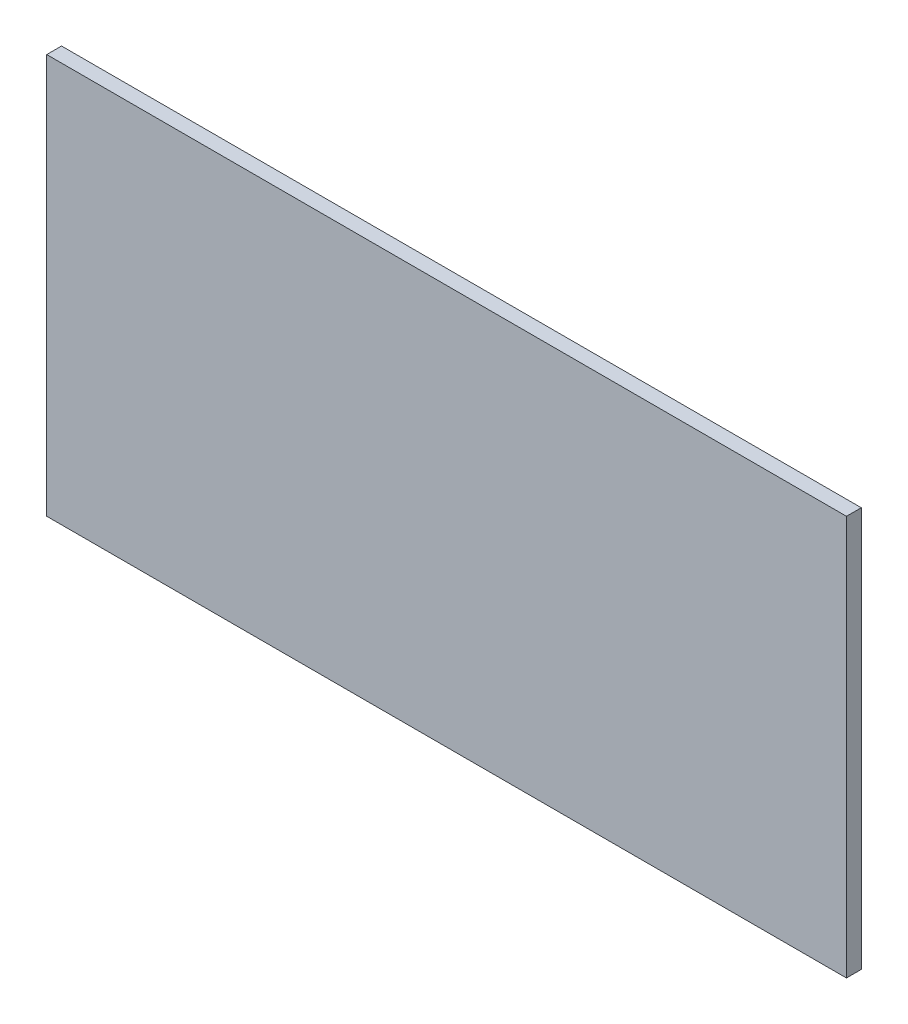
ISO-10303-21;
HEADER;
FILE_DESCRIPTION(('STEP AP214'),'2;1');
FILE_NAME('part.step','',(''),(''),'','','');
FILE_SCHEMA(('AUTOMOTIVE_DESIGN { 1 0 10303 214 1 1 1 1 }'));
ENDSEC;
DATA;
#1=APPLICATION_CONTEXT('core data for automotive mechanical design processes');
#2=APPLICATION_PROTOCOL_DEFINITION('international standard','automotive_design',2000,#1);
#3=PRODUCT_CONTEXT('',#1,'mechanical');
#4=PRODUCT('Part','Part','',(#3));
#5=PRODUCT_RELATED_PRODUCT_CATEGORY('part','',(#4));
#6=PRODUCT_DEFINITION_FORMATION('','',#4);
#7=PRODUCT_DEFINITION_CONTEXT('part definition',#1,'design');
#8=PRODUCT_DEFINITION('design','',#6,#7);
#9=PRODUCT_DEFINITION_SHAPE('','',#8);
#10=(LENGTH_UNIT() NAMED_UNIT(*) SI_UNIT(.MILLI.,.METRE.));
#11=(NAMED_UNIT(*) PLANE_ANGLE_UNIT() SI_UNIT($,.RADIAN.));
#12=(NAMED_UNIT(*) SI_UNIT($,.STERADIAN.) SOLID_ANGLE_UNIT());
#13=UNCERTAINTY_MEASURE_WITH_UNIT(LENGTH_MEASURE(1.E-05),#10,'distance_accuracy_value','');
#14=(GEOMETRIC_REPRESENTATION_CONTEXT(3) GLOBAL_UNCERTAINTY_ASSIGNED_CONTEXT((#13)) GLOBAL_UNIT_ASSIGNED_CONTEXT((#10,
#11,#12)) REPRESENTATION_CONTEXT('',''));
#15=CARTESIAN_POINT('',(0.,0.,0.));
#16=DIRECTION('',(0.,0.,1.));
#17=DIRECTION('',(1.,0.,0.));
#18=AXIS2_PLACEMENT_3D('',#15,#16,#17);
#19=CARTESIAN_POINT('',(270.,135.,10.));
#20=DIRECTION('',(-1.,0.,0.));
#21=DIRECTION('',(0.,-1.,0.));
#22=AXIS2_PLACEMENT_3D('',#19,#20,#21);
#23=PLANE('',#22);
#24=DIRECTION('',(0.,1.,0.));
#25=VECTOR('',#24,1.);
#26=CARTESIAN_POINT('',(270.,135.,0.));
#27=LINE('',#26,#25);
#28=CARTESIAN_POINT('',(270.,-135.,0.));
#29=VERTEX_POINT('',#28);
#30=CARTESIAN_POINT('',(270.,135.,0.));
#31=VERTEX_POINT('',#30);
#32=EDGE_CURVE('E95',#29,#31,#27,.T.);
#33=ORIENTED_EDGE('',*,*,#32,.T.);
#34=DIRECTION('',(0.,0.,-1.));
#35=VECTOR('',#34,1.);
#36=CARTESIAN_POINT('',(270.,135.,10.));
#37=LINE('',#36,#35);
#38=CARTESIAN_POINT('',(270.,135.,10.));
#39=VERTEX_POINT('',#38);
#40=EDGE_CURVE('E11',#39,#31,#37,.T.);
#41=ORIENTED_EDGE('',*,*,#40,.F.);
#42=DIRECTION('',(0.,1.,0.));
#43=VECTOR('',#42,1.);
#44=CARTESIAN_POINT('',(270.,135.,10.));
#45=LINE('',#44,#43);
#46=CARTESIAN_POINT('',(270.,-135.,10.));
#47=VERTEX_POINT('',#46);
#48=EDGE_CURVE('E83',#47,#39,#45,.T.);
#49=ORIENTED_EDGE('',*,*,#48,.F.);
#50=DIRECTION('',(0.,0.,-1.));
#51=VECTOR('',#50,1.);
#52=CARTESIAN_POINT('',(270.,-135.,10.));
#53=LINE('',#52,#51);
#54=EDGE_CURVE('E91',#47,#29,#53,.T.);
#55=ORIENTED_EDGE('',*,*,#54,.T.);
#56=EDGE_LOOP('',(#33,#41,#49,#55));
#57=FACE_BOUND('',#56,.T.);
#58=ADVANCED_FACE('F32',(#57),#23,.F.);
#59=CARTESIAN_POINT('',(-270.,135.,10.));
#60=DIRECTION('',(0.,-1.,0.));
#61=DIRECTION('',(0.,0.,-1.));
#62=AXIS2_PLACEMENT_3D('',#59,#60,#61);
#63=PLANE('',#62);
#64=DIRECTION('',(-1.,0.,0.));
#65=VECTOR('',#64,1.);
#66=CARTESIAN_POINT('',(-270.,135.,0.));
#67=LINE('',#66,#65);
#68=CARTESIAN_POINT('',(-270.,135.,0.));
#69=VERTEX_POINT('',#68);
#70=EDGE_CURVE('E87',#31,#69,#67,.T.);
#71=ORIENTED_EDGE('',*,*,#70,.T.);
#72=DIRECTION('',(0.,0.,-1.));
#73=VECTOR('',#72,1.);
#74=CARTESIAN_POINT('',(-270.,135.,10.));
#75=LINE('',#74,#73);
#76=CARTESIAN_POINT('',(-270.,135.,10.));
#77=VERTEX_POINT('',#76);
#78=EDGE_CURVE('E40',#77,#69,#75,.T.);
#79=ORIENTED_EDGE('',*,*,#78,.F.);
#80=DIRECTION('',(-1.,0.,0.));
#81=VECTOR('',#80,1.);
#82=CARTESIAN_POINT('',(-270.,135.,10.));
#83=LINE('',#82,#81);
#84=EDGE_CURVE('E78',#39,#77,#83,.T.);
#85=ORIENTED_EDGE('',*,*,#84,.F.);
#86=ORIENTED_EDGE('',*,*,#40,.T.);
#87=EDGE_LOOP('',(#71,#79,#85,#86));
#88=FACE_BOUND('',#87,.T.);
#89=ADVANCED_FACE('F86',(#88),#63,.F.);
#90=CARTESIAN_POINT('',(-270.,135.,10.));
#91=DIRECTION('',(1.,0.,0.));
#92=DIRECTION('',(0.,1.,0.));
#93=AXIS2_PLACEMENT_3D('',#90,#91,#92);
#94=PLANE('',#93);
#95=DIRECTION('',(0.,-1.,0.));
#96=VECTOR('',#95,1.);
#97=CARTESIAN_POINT('',(-270.,135.,0.));
#98=LINE('',#97,#96);
#99=CARTESIAN_POINT('',(-270.,-135.,0.));
#100=VERTEX_POINT('',#99);
#101=EDGE_CURVE('E65',#69,#100,#98,.T.);
#102=ORIENTED_EDGE('',*,*,#101,.T.);
#103=DIRECTION('',(0.,0.,-1.));
#104=VECTOR('',#103,1.);
#105=CARTESIAN_POINT('',(-270.,-135.,10.));
#106=LINE('',#105,#104);
#107=CARTESIAN_POINT('',(-270.,-135.,10.));
#108=VERTEX_POINT('',#107);
#109=EDGE_CURVE('E88',#108,#100,#106,.T.);
#110=ORIENTED_EDGE('',*,*,#109,.F.);
#111=DIRECTION('',(0.,-1.,0.));
#112=VECTOR('',#111,1.);
#113=CARTESIAN_POINT('',(-270.,135.,10.));
#114=LINE('',#113,#112);
#115=EDGE_CURVE('E81',#77,#108,#114,.T.);
#116=ORIENTED_EDGE('',*,*,#115,.F.);
#117=ORIENTED_EDGE('',*,*,#78,.T.);
#118=EDGE_LOOP('',(#102,#110,#116,#117));
#119=FACE_BOUND('',#118,.T.);
#120=ADVANCED_FACE('F89',(#119),#94,.F.);
#121=CARTESIAN_POINT('',(-270.,-135.,10.));
#122=DIRECTION('',(0.,1.,0.));
#123=DIRECTION('',(0.,0.,1.));
#124=AXIS2_PLACEMENT_3D('',#121,#122,#123);
#125=PLANE('',#124);
#126=DIRECTION('',(1.,0.,0.));
#127=VECTOR('',#126,1.);
#128=CARTESIAN_POINT('',(-270.,-135.,0.));
#129=LINE('',#128,#127);
#130=EDGE_CURVE('E71',#100,#29,#129,.T.);
#131=ORIENTED_EDGE('',*,*,#130,.T.);
#132=ORIENTED_EDGE('',*,*,#54,.F.);
#133=DIRECTION('',(1.,0.,0.));
#134=VECTOR('',#133,1.);
#135=CARTESIAN_POINT('',(-270.,-135.,10.));
#136=LINE('',#135,#134);
#137=EDGE_CURVE('E48',#108,#47,#136,.T.);
#138=ORIENTED_EDGE('',*,*,#137,.F.);
#139=ORIENTED_EDGE('',*,*,#109,.T.);
#140=EDGE_LOOP('',(#131,#132,#138,#139));
#141=FACE_BOUND('',#140,.T.);
#142=ADVANCED_FACE('F102',(#141),#125,.F.);
#143=CARTESIAN_POINT('',(0.,0.,10.));
#144=DIRECTION('',(0.,0.,1.));
#145=DIRECTION('',(1.,0.,0.));
#146=AXIS2_PLACEMENT_3D('',#143,#144,#145);
#147=PLANE('',#146);
#148=ORIENTED_EDGE('',*,*,#48,.T.);
#149=ORIENTED_EDGE('',*,*,#84,.T.);
#150=ORIENTED_EDGE('',*,*,#115,.T.);
#151=ORIENTED_EDGE('',*,*,#137,.T.);
#152=EDGE_LOOP('',(#148,#149,#150,#151));
#153=FACE_BOUND('',#152,.T.);
#154=ADVANCED_FACE('F79',(#153),#147,.T.);
#155=CARTESIAN_POINT('',(0.,0.,0.));
#156=DIRECTION('',(0.,0.,1.));
#157=DIRECTION('',(1.,0.,0.));
#158=AXIS2_PLACEMENT_3D('',#155,#156,#157);
#159=PLANE('',#158);
#160=ORIENTED_EDGE('',*,*,#32,.F.);
#161=ORIENTED_EDGE('',*,*,#130,.F.);
#162=ORIENTED_EDGE('',*,*,#101,.F.);
#163=ORIENTED_EDGE('',*,*,#70,.F.);
#164=EDGE_LOOP('',(#160,#161,#162,#163));
#165=FACE_BOUND('',#164,.T.);
#166=ADVANCED_FACE('F105',(#165),#159,.F.);
#167=CLOSED_SHELL('',(#58,#89,#120,#142,#154,#166));
#168=MANIFOLD_SOLID_BREP('B2',#167);
#169=ADVANCED_BREP_SHAPE_REPRESENTATION('',(#18,#168),#14);
#170=SHAPE_DEFINITION_REPRESENTATION(#9,#169);
ENDSEC;
END-ISO-10303-21;
